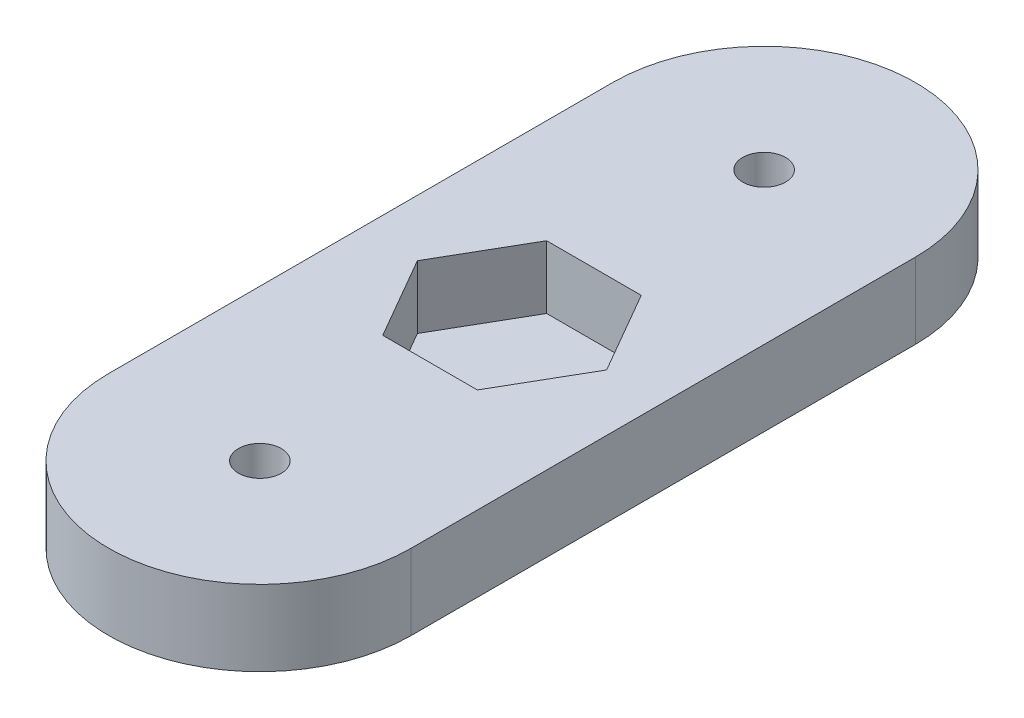
ISO-10303-21;
HEADER;
FILE_DESCRIPTION(('STEP AP214'),'2;1');
FILE_NAME('part.step','',(''),(''),'','','');
FILE_SCHEMA(('AUTOMOTIVE_DESIGN { 1 0 10303 214 1 1 1 1 }'));
ENDSEC;
DATA;
#1=APPLICATION_CONTEXT('core data for automotive mechanical design processes');
#2=APPLICATION_PROTOCOL_DEFINITION('international standard','automotive_design',2000,#1);
#3=PRODUCT_CONTEXT('',#1,'mechanical');
#4=PRODUCT('Part','Part','',(#3));
#5=PRODUCT_RELATED_PRODUCT_CATEGORY('part','',(#4));
#6=PRODUCT_DEFINITION_FORMATION('','',#4);
#7=PRODUCT_DEFINITION_CONTEXT('part definition',#1,'design');
#8=PRODUCT_DEFINITION('design','',#6,#7);
#9=PRODUCT_DEFINITION_SHAPE('','',#8);
#10=(LENGTH_UNIT() NAMED_UNIT(*) SI_UNIT(.MILLI.,.METRE.));
#11=(NAMED_UNIT(*) PLANE_ANGLE_UNIT() SI_UNIT($,.RADIAN.));
#12=(NAMED_UNIT(*) SI_UNIT($,.STERADIAN.) SOLID_ANGLE_UNIT());
#13=UNCERTAINTY_MEASURE_WITH_UNIT(LENGTH_MEASURE(1.E-05),#10,'distance_accuracy_value','');
#14=(GEOMETRIC_REPRESENTATION_CONTEXT(3) GLOBAL_UNCERTAINTY_ASSIGNED_CONTEXT((#13)) GLOBAL_UNIT_ASSIGNED_CONTEXT((#10,
#11,#12)) REPRESENTATION_CONTEXT('',''));
#15=CARTESIAN_POINT('',(0.,0.,0.));
#16=DIRECTION('',(0.,0.,1.));
#17=DIRECTION('',(1.,0.,0.));
#18=AXIS2_PLACEMENT_3D('',#15,#16,#17);
#19=CARTESIAN_POINT('',(0.,6.,0.));
#20=DIRECTION('',(0.,1.,0.));
#21=DIRECTION('',(0.,0.,1.));
#22=AXIS2_PLACEMENT_3D('',#19,#20,#21);
#23=PLANE('',#22);
#24=DIRECTION('',(1.,0.,0.));
#25=VECTOR('',#24,1.);
#26=CARTESIAN_POINT('',(-3.75277674973254,6.,-13.5));
#27=LINE('',#26,#25);
#28=CARTESIAN_POINT('',(-3.75277674973254,6.,-13.5));
#29=VERTEX_POINT('',#28);
#30=CARTESIAN_POINT('',(3.75277674973259,6.,-13.5));
#31=VERTEX_POINT('',#30);
#32=EDGE_CURVE('E48',#29,#31,#27,.T.);
#33=ORIENTED_EDGE('',*,*,#32,.F.);
#34=DIRECTION('',(0.500000000000004,0.,0.866025403784436));
#35=VECTOR('',#34,1.);
#36=CARTESIAN_POINT('',(-7.50555349946514,6.,-20.));
#37=LINE('',#36,#35);
#38=CARTESIAN_POINT('',(-7.50555349946514,6.,-20.));
#39=VERTEX_POINT('',#38);
#40=EDGE_CURVE('E140',#39,#29,#37,.T.);
#41=ORIENTED_EDGE('',*,*,#40,.F.);
#42=DIRECTION('',(-0.499999999999997,0.,0.86602540378444));
#43=VECTOR('',#42,1.);
#44=CARTESIAN_POINT('',(-3.7527767497326,6.,-26.5));
#45=LINE('',#44,#43);
#46=CARTESIAN_POINT('',(-3.7527767497326,6.,-26.5));
#47=VERTEX_POINT('',#46);
#48=EDGE_CURVE('E143',#47,#39,#45,.T.);
#49=ORIENTED_EDGE('',*,*,#48,.F.);
#50=DIRECTION('',(-1.,0.,0.));
#51=VECTOR('',#50,1.);
#52=CARTESIAN_POINT('',(3.75277674973256,6.,-26.5));
#53=LINE('',#52,#51);
#54=CARTESIAN_POINT('',(3.75277674973256,6.,-26.5));
#55=VERTEX_POINT('',#54);
#56=EDGE_CURVE('E159',#55,#47,#53,.T.);
#57=ORIENTED_EDGE('',*,*,#56,.F.);
#58=DIRECTION('',(-0.500000000000002,0.,-0.866025403784438));
#59=VECTOR('',#58,1.);
#60=CARTESIAN_POINT('',(7.50555349946513,6.,-20.));
#61=LINE('',#60,#59);
#62=CARTESIAN_POINT('',(7.50555349946513,6.,-20.));
#63=VERTEX_POINT('',#62);
#64=EDGE_CURVE('E156',#63,#55,#61,.T.);
#65=ORIENTED_EDGE('',*,*,#64,.F.);
#66=DIRECTION('',(0.499999999999997,0.,-0.86602540378444));
#67=VECTOR('',#66,1.);
#68=CARTESIAN_POINT('',(3.75277674973259,6.,-13.5));
#69=LINE('',#68,#67);
#70=EDGE_CURVE('E154',#31,#63,#69,.T.);
#71=ORIENTED_EDGE('',*,*,#70,.F.);
#72=EDGE_LOOP('',(#33,#41,#49,#57,#65,#71));
#73=FACE_BOUND('',#72,.T.);
#74=CARTESIAN_POINT('',(0.,6.,-40.));
#75=DIRECTION('',(0.,1.,0.));
#76=DIRECTION('',(0.,0.,1.));
#77=AXIS2_PLACEMENT_3D('',#74,#75,#76);
#78=CIRCLE('',#77,1.7);
#79=CARTESIAN_POINT('',(0.,6.,-38.3));
#80=VERTEX_POINT('',#79);
#81=EDGE_CURVE('E180',#80,#80,#78,.T.);
#82=ORIENTED_EDGE('',*,*,#81,.F.);
#83=EDGE_LOOP('',(#82));
#84=FACE_BOUND('',#83,.T.);
#85=CARTESIAN_POINT('',(0.,6.,0.));
#86=DIRECTION('',(0.,1.,0.));
#87=DIRECTION('',(0.,0.,1.));
#88=AXIS2_PLACEMENT_3D('',#85,#86,#87);
#89=CIRCLE('',#88,12.);
#90=CARTESIAN_POINT('',(-12.,6.,0.));
#91=VERTEX_POINT('',#90);
#92=CARTESIAN_POINT('',(12.,6.,0.));
#93=VERTEX_POINT('',#92);
#94=EDGE_CURVE('E186',#91,#93,#89,.T.);
#95=ORIENTED_EDGE('',*,*,#94,.T.);
#96=DIRECTION('',(0.,0.,-1.));
#97=VECTOR('',#96,1.);
#98=CARTESIAN_POINT('',(12.,6.,0.));
#99=LINE('',#98,#97);
#100=CARTESIAN_POINT('',(12.,6.,-40.));
#101=VERTEX_POINT('',#100);
#102=EDGE_CURVE('E85',#93,#101,#99,.T.);
#103=ORIENTED_EDGE('',*,*,#102,.T.);
#104=CARTESIAN_POINT('',(0.,6.,-40.));
#105=DIRECTION('',(0.,1.,0.));
#106=DIRECTION('',(0.,0.,1.));
#107=AXIS2_PLACEMENT_3D('',#104,#105,#106);
#108=CIRCLE('',#107,12.);
#109=CARTESIAN_POINT('',(-12.,6.,-40.));
#110=VERTEX_POINT('',#109);
#111=EDGE_CURVE('E189',#101,#110,#108,.T.);
#112=ORIENTED_EDGE('',*,*,#111,.T.);
#113=DIRECTION('',(0.,0.,1.));
#114=VECTOR('',#113,1.);
#115=CARTESIAN_POINT('',(-12.,6.,0.));
#116=LINE('',#115,#114);
#117=EDGE_CURVE('E57',#110,#91,#116,.T.);
#118=ORIENTED_EDGE('',*,*,#117,.T.);
#119=EDGE_LOOP('',(#95,#103,#112,#118));
#120=FACE_BOUND('',#119,.T.);
#121=CARTESIAN_POINT('',(0.,6.,0.));
#122=DIRECTION('',(0.,1.,0.));
#123=DIRECTION('',(0.,0.,1.));
#124=AXIS2_PLACEMENT_3D('',#121,#122,#123);
#125=CIRCLE('',#124,1.7);
#126=CARTESIAN_POINT('',(0.,6.,1.7));
#127=VERTEX_POINT('',#126);
#128=EDGE_CURVE('E174',#127,#127,#125,.T.);
#129=ORIENTED_EDGE('',*,*,#128,.F.);
#130=EDGE_LOOP('',(#129));
#131=FACE_BOUND('',#130,.T.);
#132=ADVANCED_FACE('F33',(#73,#84,#120,#131),#23,.T.);
#133=CARTESIAN_POINT('',(0.,0.,0.));
#134=DIRECTION('',(0.,1.,0.));
#135=DIRECTION('',(0.,0.,1.));
#136=AXIS2_PLACEMENT_3D('',#133,#134,#135);
#137=PLANE('',#136);
#138=CARTESIAN_POINT('',(0.,0.,-40.));
#139=DIRECTION('',(0.,1.,0.));
#140=DIRECTION('',(0.,0.,1.));
#141=AXIS2_PLACEMENT_3D('',#138,#139,#140);
#142=CIRCLE('',#141,1.7);
#143=CARTESIAN_POINT('',(0.,0.,-38.3));
#144=VERTEX_POINT('',#143);
#145=EDGE_CURVE('E177',#144,#144,#142,.T.);
#146=ORIENTED_EDGE('',*,*,#145,.T.);
#147=EDGE_LOOP('',(#146));
#148=FACE_BOUND('',#147,.T.);
#149=CARTESIAN_POINT('',(0.,0.,0.));
#150=DIRECTION('',(0.,1.,0.));
#151=DIRECTION('',(0.,0.,1.));
#152=AXIS2_PLACEMENT_3D('',#149,#150,#151);
#153=CIRCLE('',#152,12.);
#154=CARTESIAN_POINT('',(-12.,0.,0.));
#155=VERTEX_POINT('',#154);
#156=CARTESIAN_POINT('',(12.,0.,0.));
#157=VERTEX_POINT('',#156);
#158=EDGE_CURVE('E183',#155,#157,#153,.T.);
#159=ORIENTED_EDGE('',*,*,#158,.F.);
#160=DIRECTION('',(0.,0.,1.));
#161=VECTOR('',#160,1.);
#162=CARTESIAN_POINT('',(-12.,0.,0.));
#163=LINE('',#162,#161);
#164=CARTESIAN_POINT('',(-12.,0.,-40.));
#165=VERTEX_POINT('',#164);
#166=EDGE_CURVE('E78',#165,#155,#163,.T.);
#167=ORIENTED_EDGE('',*,*,#166,.F.);
#168=CARTESIAN_POINT('',(0.,0.,-40.));
#169=DIRECTION('',(0.,1.,0.));
#170=DIRECTION('',(0.,0.,1.));
#171=AXIS2_PLACEMENT_3D('',#168,#169,#170);
#172=CIRCLE('',#171,12.);
#173=CARTESIAN_POINT('',(12.,0.,-40.));
#174=VERTEX_POINT('',#173);
#175=EDGE_CURVE('E197',#174,#165,#172,.T.);
#176=ORIENTED_EDGE('',*,*,#175,.F.);
#177=DIRECTION('',(0.,0.,-1.));
#178=VECTOR('',#177,1.);
#179=CARTESIAN_POINT('',(12.,0.,0.));
#180=LINE('',#179,#178);
#181=EDGE_CURVE('E195',#157,#174,#180,.T.);
#182=ORIENTED_EDGE('',*,*,#181,.F.);
#183=EDGE_LOOP('',(#159,#167,#176,#182));
#184=FACE_BOUND('',#183,.T.);
#185=CARTESIAN_POINT('',(0.,0.,0.));
#186=DIRECTION('',(0.,1.,0.));
#187=DIRECTION('',(0.,0.,1.));
#188=AXIS2_PLACEMENT_3D('',#185,#186,#187);
#189=CIRCLE('',#188,1.7);
#190=CARTESIAN_POINT('',(0.,0.,1.7));
#191=VERTEX_POINT('',#190);
#192=EDGE_CURVE('E166',#191,#191,#189,.T.);
#193=ORIENTED_EDGE('',*,*,#192,.T.);
#194=EDGE_LOOP('',(#193));
#195=FACE_BOUND('',#194,.T.);
#196=ADVANCED_FACE('F210',(#148,#184,#195),#137,.F.);
#197=CARTESIAN_POINT('',(0.,6.,0.));
#198=DIRECTION('',(0.,-1.,0.));
#199=DIRECTION('',(0.,0.,-1.));
#200=AXIS2_PLACEMENT_3D('',#197,#198,#199);
#201=CYLINDRICAL_SURFACE('',#200,12.);
#202=ORIENTED_EDGE('',*,*,#158,.T.);
#203=DIRECTION('',(0.,-1.,0.));
#204=VECTOR('',#203,1.);
#205=CARTESIAN_POINT('',(12.,6.,0.));
#206=LINE('',#205,#204);
#207=EDGE_CURVE('E11',#93,#157,#206,.T.);
#208=ORIENTED_EDGE('',*,*,#207,.F.);
#209=ORIENTED_EDGE('',*,*,#94,.F.);
#210=DIRECTION('',(0.,-1.,0.));
#211=VECTOR('',#210,1.);
#212=CARTESIAN_POINT('',(-12.,6.,0.));
#213=LINE('',#212,#211);
#214=EDGE_CURVE('E192',#91,#155,#213,.T.);
#215=ORIENTED_EDGE('',*,*,#214,.T.);
#216=EDGE_LOOP('',(#202,#208,#209,#215));
#217=FACE_BOUND('',#216,.T.);
#218=ADVANCED_FACE('F35',(#217),#201,.T.);
#219=CARTESIAN_POINT('',(12.,6.,0.));
#220=DIRECTION('',(-1.,0.,0.));
#221=DIRECTION('',(0.,0.,1.));
#222=AXIS2_PLACEMENT_3D('',#219,#220,#221);
#223=PLANE('',#222);
#224=ORIENTED_EDGE('',*,*,#181,.T.);
#225=DIRECTION('',(0.,-1.,0.));
#226=VECTOR('',#225,1.);
#227=CARTESIAN_POINT('',(12.,6.,-40.));
#228=LINE('',#227,#226);
#229=EDGE_CURVE('E41',#101,#174,#228,.T.);
#230=ORIENTED_EDGE('',*,*,#229,.F.);
#231=ORIENTED_EDGE('',*,*,#102,.F.);
#232=ORIENTED_EDGE('',*,*,#207,.T.);
#233=EDGE_LOOP('',(#224,#230,#231,#232));
#234=FACE_BOUND('',#233,.T.);
#235=ADVANCED_FACE('F226',(#234),#223,.F.);
#236=CARTESIAN_POINT('',(0.,6.,-40.));
#237=DIRECTION('',(0.,-1.,0.));
#238=DIRECTION('',(0.,0.,-1.));
#239=AXIS2_PLACEMENT_3D('',#236,#237,#238);
#240=CYLINDRICAL_SURFACE('',#239,12.);
#241=ORIENTED_EDGE('',*,*,#175,.T.);
#242=DIRECTION('',(0.,-1.,0.));
#243=VECTOR('',#242,1.);
#244=CARTESIAN_POINT('',(-12.,6.,-40.));
#245=LINE('',#244,#243);
#246=EDGE_CURVE('E201',#110,#165,#245,.T.);
#247=ORIENTED_EDGE('',*,*,#246,.F.);
#248=ORIENTED_EDGE('',*,*,#111,.F.);
#249=ORIENTED_EDGE('',*,*,#229,.T.);
#250=EDGE_LOOP('',(#241,#247,#248,#249));
#251=FACE_BOUND('',#250,.T.);
#252=ADVANCED_FACE('F206',(#251),#240,.T.);
#253=CARTESIAN_POINT('',(-12.,6.,0.));
#254=DIRECTION('',(1.,0.,0.));
#255=DIRECTION('',(0.,0.,-1.));
#256=AXIS2_PLACEMENT_3D('',#253,#254,#255);
#257=PLANE('',#256);
#258=ORIENTED_EDGE('',*,*,#166,.T.);
#259=ORIENTED_EDGE('',*,*,#214,.F.);
#260=ORIENTED_EDGE('',*,*,#117,.F.);
#261=ORIENTED_EDGE('',*,*,#246,.T.);
#262=EDGE_LOOP('',(#258,#259,#260,#261));
#263=FACE_BOUND('',#262,.T.);
#264=ADVANCED_FACE('F215',(#263),#257,.F.);
#265=CARTESIAN_POINT('',(0.,6.,-40.));
#266=DIRECTION('',(0.,-1.,0.));
#267=DIRECTION('',(0.,0.,-1.));
#268=AXIS2_PLACEMENT_3D('',#265,#266,#267);
#269=CYLINDRICAL_SURFACE('',#268,1.7);
#270=ORIENTED_EDGE('',*,*,#81,.T.);
#271=EDGE_LOOP('',(#270));
#272=FACE_BOUND('',#271,.T.);
#273=ORIENTED_EDGE('',*,*,#145,.F.);
#274=EDGE_LOOP('',(#273));
#275=FACE_BOUND('',#274,.T.);
#276=ADVANCED_FACE('F217',(#272,#275),#269,.F.);
#277=CARTESIAN_POINT('',(0.,6.,0.));
#278=DIRECTION('',(0.,-1.,0.));
#279=DIRECTION('',(0.,0.,-1.));
#280=AXIS2_PLACEMENT_3D('',#277,#278,#279);
#281=CYLINDRICAL_SURFACE('',#280,1.7);
#282=ORIENTED_EDGE('',*,*,#128,.T.);
#283=EDGE_LOOP('',(#282));
#284=FACE_BOUND('',#283,.T.);
#285=ORIENTED_EDGE('',*,*,#192,.F.);
#286=EDGE_LOOP('',(#285));
#287=FACE_BOUND('',#286,.T.);
#288=ADVANCED_FACE('F223',(#284,#287),#281,.F.);
#289=CARTESIAN_POINT('',(-3.75277674973254,1.,-13.5));
#290=DIRECTION('',(0.,0.,1.));
#291=DIRECTION('',(1.,0.,0.));
#292=AXIS2_PLACEMENT_3D('',#289,#290,#291);
#293=PLANE('',#292);
#294=ORIENTED_EDGE('',*,*,#32,.T.);
#295=DIRECTION('',(0.,1.,0.));
#296=VECTOR('',#295,1.);
#297=CARTESIAN_POINT('',(3.75277674973259,1.,-13.5));
#298=LINE('',#297,#296);
#299=CARTESIAN_POINT('',(3.75277674973259,1.,-13.5));
#300=VERTEX_POINT('',#299);
#301=EDGE_CURVE('E117',#300,#31,#298,.T.);
#302=ORIENTED_EDGE('',*,*,#301,.F.);
#303=DIRECTION('',(1.,0.,0.));
#304=VECTOR('',#303,1.);
#305=CARTESIAN_POINT('',(-3.75277674973254,1.,-13.5));
#306=LINE('',#305,#304);
#307=CARTESIAN_POINT('',(-3.75277674973254,1.,-13.5));
#308=VERTEX_POINT('',#307);
#309=EDGE_CURVE('E121',#308,#300,#306,.T.);
#310=ORIENTED_EDGE('',*,*,#309,.F.);
#311=DIRECTION('',(0.,1.,0.));
#312=VECTOR('',#311,1.);
#313=CARTESIAN_POINT('',(-3.75277674973254,1.,-13.5));
#314=LINE('',#313,#312);
#315=EDGE_CURVE('E164',#308,#29,#314,.T.);
#316=ORIENTED_EDGE('',*,*,#315,.T.);
#317=EDGE_LOOP('',(#294,#302,#310,#316));
#318=FACE_BOUND('',#317,.T.);
#319=ADVANCED_FACE('F119',(#318),#293,.F.);
#320=CARTESIAN_POINT('',(-7.50555349946514,1.,-20.));
#321=DIRECTION('',(-0.866025403784436,0.,0.500000000000004));
#322=DIRECTION('',(0.500000000000004,0.,0.866025403784436));
#323=AXIS2_PLACEMENT_3D('',#320,#321,#322);
#324=PLANE('',#323);
#325=ORIENTED_EDGE('',*,*,#40,.T.);
#326=ORIENTED_EDGE('',*,*,#315,.F.);
#327=DIRECTION('',(0.500000000000004,0.,0.866025403784436));
#328=VECTOR('',#327,1.);
#329=CARTESIAN_POINT('',(-7.50555349946514,1.,-20.));
#330=LINE('',#329,#328);
#331=CARTESIAN_POINT('',(-7.50555349946514,1.,-20.));
#332=VERTEX_POINT('',#331);
#333=EDGE_CURVE('E127',#332,#308,#330,.T.);
#334=ORIENTED_EDGE('',*,*,#333,.F.);
#335=DIRECTION('',(0.,1.,0.));
#336=VECTOR('',#335,1.);
#337=CARTESIAN_POINT('',(-7.50555349946514,1.,-20.));
#338=LINE('',#337,#336);
#339=EDGE_CURVE('E167',#332,#39,#338,.T.);
#340=ORIENTED_EDGE('',*,*,#339,.T.);
#341=EDGE_LOOP('',(#325,#326,#334,#340));
#342=FACE_BOUND('',#341,.T.);
#343=ADVANCED_FACE('F243',(#342),#324,.F.);
#344=CARTESIAN_POINT('',(-3.7527767497326,1.,-26.5));
#345=DIRECTION('',(-0.86602540378444,0.,-0.499999999999997));
#346=DIRECTION('',(-0.499999999999997,0.,0.86602540378444));
#347=AXIS2_PLACEMENT_3D('',#344,#345,#346);
#348=PLANE('',#347);
#349=ORIENTED_EDGE('',*,*,#48,.T.);
#350=ORIENTED_EDGE('',*,*,#339,.F.);
#351=DIRECTION('',(-0.499999999999997,0.,0.86602540378444));
#352=VECTOR('',#351,1.);
#353=CARTESIAN_POINT('',(-3.7527767497326,1.,-26.5));
#354=LINE('',#353,#352);
#355=CARTESIAN_POINT('',(-3.7527767497326,1.,-26.5));
#356=VERTEX_POINT('',#355);
#357=EDGE_CURVE('E150',#356,#332,#354,.T.);
#358=ORIENTED_EDGE('',*,*,#357,.F.);
#359=DIRECTION('',(0.,1.,0.));
#360=VECTOR('',#359,1.);
#361=CARTESIAN_POINT('',(-3.7527767497326,1.,-26.5));
#362=LINE('',#361,#360);
#363=EDGE_CURVE('E169',#356,#47,#362,.T.);
#364=ORIENTED_EDGE('',*,*,#363,.T.);
#365=EDGE_LOOP('',(#349,#350,#358,#364));
#366=FACE_BOUND('',#365,.T.);
#367=ADVANCED_FACE('F253',(#366),#348,.F.);
#368=CARTESIAN_POINT('',(3.75277674973256,1.,-26.5));
#369=DIRECTION('',(0.,0.,-1.));
#370=DIRECTION('',(-1.,0.,0.));
#371=AXIS2_PLACEMENT_3D('',#368,#369,#370);
#372=PLANE('',#371);
#373=ORIENTED_EDGE('',*,*,#56,.T.);
#374=ORIENTED_EDGE('',*,*,#363,.F.);
#375=DIRECTION('',(-1.,0.,0.));
#376=VECTOR('',#375,1.);
#377=CARTESIAN_POINT('',(3.75277674973256,1.,-26.5));
#378=LINE('',#377,#376);
#379=CARTESIAN_POINT('',(3.75277674973256,1.,-26.5));
#380=VERTEX_POINT('',#379);
#381=EDGE_CURVE('E147',#380,#356,#378,.T.);
#382=ORIENTED_EDGE('',*,*,#381,.F.);
#383=DIRECTION('',(0.,1.,0.));
#384=VECTOR('',#383,1.);
#385=CARTESIAN_POINT('',(3.75277674973256,1.,-26.5));
#386=LINE('',#385,#384);
#387=EDGE_CURVE('E171',#380,#55,#386,.T.);
#388=ORIENTED_EDGE('',*,*,#387,.T.);
#389=EDGE_LOOP('',(#373,#374,#382,#388));
#390=FACE_BOUND('',#389,.T.);
#391=ADVANCED_FACE('F249',(#390),#372,.F.);
#392=CARTESIAN_POINT('',(7.50555349946513,1.,-20.));
#393=DIRECTION('',(0.866025403784438,0.,-0.500000000000002));
#394=DIRECTION('',(-0.500000000000002,0.,-0.866025403784438));
#395=AXIS2_PLACEMENT_3D('',#392,#393,#394);
#396=PLANE('',#395);
#397=ORIENTED_EDGE('',*,*,#64,.T.);
#398=ORIENTED_EDGE('',*,*,#387,.F.);
#399=DIRECTION('',(-0.500000000000002,0.,-0.866025403784438));
#400=VECTOR('',#399,1.);
#401=CARTESIAN_POINT('',(7.50555349946513,1.,-20.));
#402=LINE('',#401,#400);
#403=CARTESIAN_POINT('',(7.50555349946513,1.,-20.));
#404=VERTEX_POINT('',#403);
#405=EDGE_CURVE('E135',#404,#380,#402,.T.);
#406=ORIENTED_EDGE('',*,*,#405,.F.);
#407=DIRECTION('',(0.,1.,0.));
#408=VECTOR('',#407,1.);
#409=CARTESIAN_POINT('',(7.50555349946513,1.,-20.));
#410=LINE('',#409,#408);
#411=EDGE_CURVE('E126',#404,#63,#410,.T.);
#412=ORIENTED_EDGE('',*,*,#411,.T.);
#413=EDGE_LOOP('',(#397,#398,#406,#412));
#414=FACE_BOUND('',#413,.T.);
#415=ADVANCED_FACE('F246',(#414),#396,.F.);
#416=CARTESIAN_POINT('',(3.75277674973259,1.,-13.5));
#417=DIRECTION('',(0.86602540378444,0.,0.499999999999997));
#418=DIRECTION('',(0.499999999999997,0.,-0.86602540378444));
#419=AXIS2_PLACEMENT_3D('',#416,#417,#418);
#420=PLANE('',#419);
#421=ORIENTED_EDGE('',*,*,#70,.T.);
#422=ORIENTED_EDGE('',*,*,#411,.F.);
#423=DIRECTION('',(0.499999999999997,0.,-0.86602540378444));
#424=VECTOR('',#423,1.);
#425=CARTESIAN_POINT('',(3.75277674973259,1.,-13.5));
#426=LINE('',#425,#424);
#427=EDGE_CURVE('E130',#300,#404,#426,.T.);
#428=ORIENTED_EDGE('',*,*,#427,.F.);
#429=ORIENTED_EDGE('',*,*,#301,.T.);
#430=EDGE_LOOP('',(#421,#422,#428,#429));
#431=FACE_BOUND('',#430,.T.);
#432=ADVANCED_FACE('F131',(#431),#420,.F.);
#433=CARTESIAN_POINT('',(0.,1.,0.));
#434=DIRECTION('',(0.,1.,0.));
#435=DIRECTION('',(0.,0.,1.));
#436=AXIS2_PLACEMENT_3D('',#433,#434,#435);
#437=PLANE('',#436);
#438=ORIENTED_EDGE('',*,*,#309,.T.);
#439=ORIENTED_EDGE('',*,*,#427,.T.);
#440=ORIENTED_EDGE('',*,*,#405,.T.);
#441=ORIENTED_EDGE('',*,*,#381,.T.);
#442=ORIENTED_EDGE('',*,*,#357,.T.);
#443=ORIENTED_EDGE('',*,*,#333,.T.);
#444=EDGE_LOOP('',(#438,#439,#440,#441,#442,#443));
#445=FACE_BOUND('',#444,.T.);
#446=ADVANCED_FACE('F137',(#445),#437,.T.);
#447=CLOSED_SHELL('',(#132,#196,#218,#235,#252,#264,#276,#288,#319,#343,#367,#391,#415,#432,#446));
#448=MANIFOLD_SOLID_BREP('B2',#447);
#449=ADVANCED_BREP_SHAPE_REPRESENTATION('',(#18,#448),#14);
#450=SHAPE_DEFINITION_REPRESENTATION(#9,#449);
ENDSEC;
END-ISO-10303-21;
